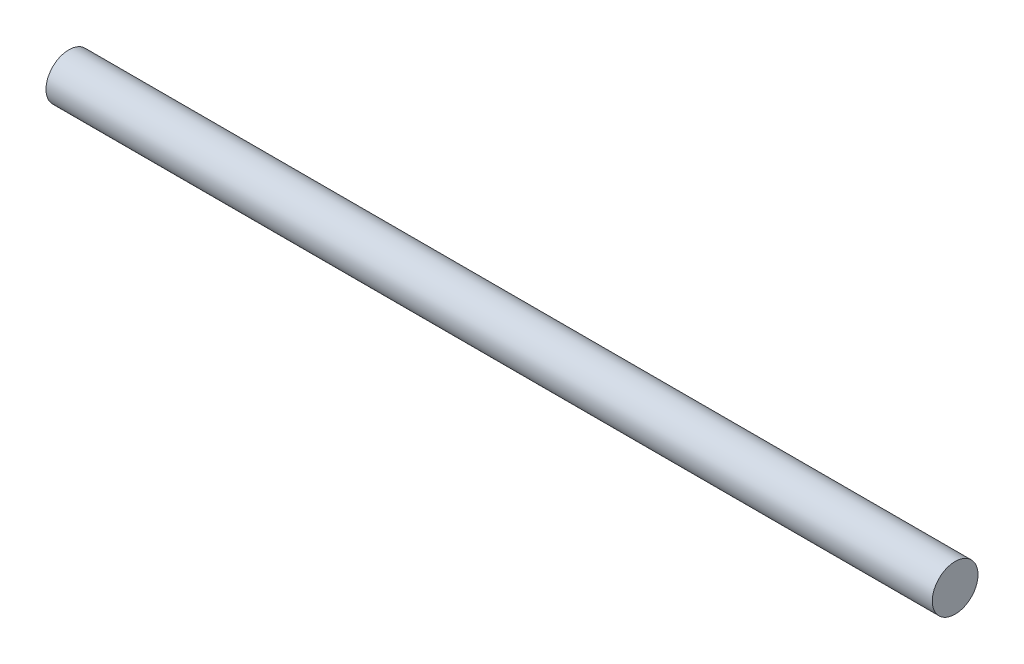
ISO-10303-21;
HEADER;
FILE_DESCRIPTION(('STEP AP214'),'2;1');
FILE_NAME('part.step','',(''),(''),'','','');
FILE_SCHEMA(('AUTOMOTIVE_DESIGN { 1 0 10303 214 1 1 1 1 }'));
ENDSEC;
DATA;
#1=APPLICATION_CONTEXT('core data for automotive mechanical design processes');
#2=APPLICATION_PROTOCOL_DEFINITION('international standard','automotive_design',2000,#1);
#3=PRODUCT_CONTEXT('',#1,'mechanical');
#4=PRODUCT('Part','Part','',(#3));
#5=PRODUCT_RELATED_PRODUCT_CATEGORY('part','',(#4));
#6=PRODUCT_DEFINITION_FORMATION('','',#4);
#7=PRODUCT_DEFINITION_CONTEXT('part definition',#1,'design');
#8=PRODUCT_DEFINITION('design','',#6,#7);
#9=PRODUCT_DEFINITION_SHAPE('','',#8);
#10=(LENGTH_UNIT() NAMED_UNIT(*) SI_UNIT(.MILLI.,.METRE.));
#11=(NAMED_UNIT(*) PLANE_ANGLE_UNIT() SI_UNIT($,.RADIAN.));
#12=(NAMED_UNIT(*) SI_UNIT($,.STERADIAN.) SOLID_ANGLE_UNIT());
#13=UNCERTAINTY_MEASURE_WITH_UNIT(LENGTH_MEASURE(1.E-05),#10,'distance_accuracy_value','');
#14=(GEOMETRIC_REPRESENTATION_CONTEXT(3) GLOBAL_UNCERTAINTY_ASSIGNED_CONTEXT((#13)) GLOBAL_UNIT_ASSIGNED_CONTEXT((#10,
#11,#12)) REPRESENTATION_CONTEXT('',''));
#15=CARTESIAN_POINT('',(0.,0.,0.));
#16=DIRECTION('',(0.,0.,1.));
#17=DIRECTION('',(1.,0.,0.));
#18=AXIS2_PLACEMENT_3D('',#15,#16,#17);
#19=CARTESIAN_POINT('',(74.31085011916,119.089042556736,137.862132194348));
#20=DIRECTION('',(-1.,0.,0.));
#21=DIRECTION('',(0.,-1.,0.));
#22=AXIS2_PLACEMENT_3D('',#19,#20,#21);
#23=CYLINDRICAL_SURFACE('',#22,2.03200000000001);
#24=CARTESIAN_POINT('',(74.31085011916,119.089042556736,137.862132194348));
#25=DIRECTION('',(-1.,0.,0.));
#26=DIRECTION('',(0.,-1.,0.));
#27=AXIS2_PLACEMENT_3D('',#24,#25,#26);
#28=CIRCLE('',#27,2.03200000000001);
#29=CARTESIAN_POINT('',(74.31085011916,117.057042556736,137.862132194348));
#30=VERTEX_POINT('',#29);
#31=EDGE_CURVE('E10',#30,#30,#28,.T.);
#32=ORIENTED_EDGE('',*,*,#31,.T.);
#33=EDGE_LOOP('',(#32));
#34=FACE_BOUND('',#33,.T.);
#35=CARTESIAN_POINT('',(-4.42914988084,119.089042556736,137.862132194348));
#36=DIRECTION('',(-1.,0.,0.));
#37=DIRECTION('',(0.,-1.,0.));
#38=AXIS2_PLACEMENT_3D('',#35,#36,#37);
#39=CIRCLE('',#38,2.03200000000001);
#40=CARTESIAN_POINT('',(-4.42914988084,117.057042556736,137.862132194348));
#41=VERTEX_POINT('',#40);
#42=EDGE_CURVE('E36',#41,#41,#39,.T.);
#43=ORIENTED_EDGE('',*,*,#42,.F.);
#44=EDGE_LOOP('',(#43));
#45=FACE_BOUND('',#44,.T.);
#46=ADVANCED_FACE('F33',(#34,#45),#23,.T.);
#47=CARTESIAN_POINT('',(74.31085011916,119.089042556736,137.862132194348));
#48=DIRECTION('',(-1.,0.,0.));
#49=DIRECTION('',(0.,-1.,0.));
#50=AXIS2_PLACEMENT_3D('',#47,#48,#49);
#51=PLANE('',#50);
#52=ORIENTED_EDGE('',*,*,#31,.F.);
#53=EDGE_LOOP('',(#52));
#54=FACE_BOUND('',#53,.T.);
#55=ADVANCED_FACE('F48',(#54),#51,.F.);
#56=CARTESIAN_POINT('',(-4.42914988084,119.089042556736,137.862132194348));
#57=DIRECTION('',(-1.,0.,0.));
#58=DIRECTION('',(0.,-1.,0.));
#59=AXIS2_PLACEMENT_3D('',#56,#57,#58);
#60=PLANE('',#59);
#61=ORIENTED_EDGE('',*,*,#42,.T.);
#62=EDGE_LOOP('',(#61));
#63=FACE_BOUND('',#62,.T.);
#64=ADVANCED_FACE('F45',(#63),#60,.T.);
#65=CLOSED_SHELL('',(#46,#55,#64));
#66=MANIFOLD_SOLID_BREP('B2',#65);
#67=ADVANCED_BREP_SHAPE_REPRESENTATION('',(#18,#66),#14);
#68=SHAPE_DEFINITION_REPRESENTATION(#9,#67);
ENDSEC;
END-ISO-10303-21;
